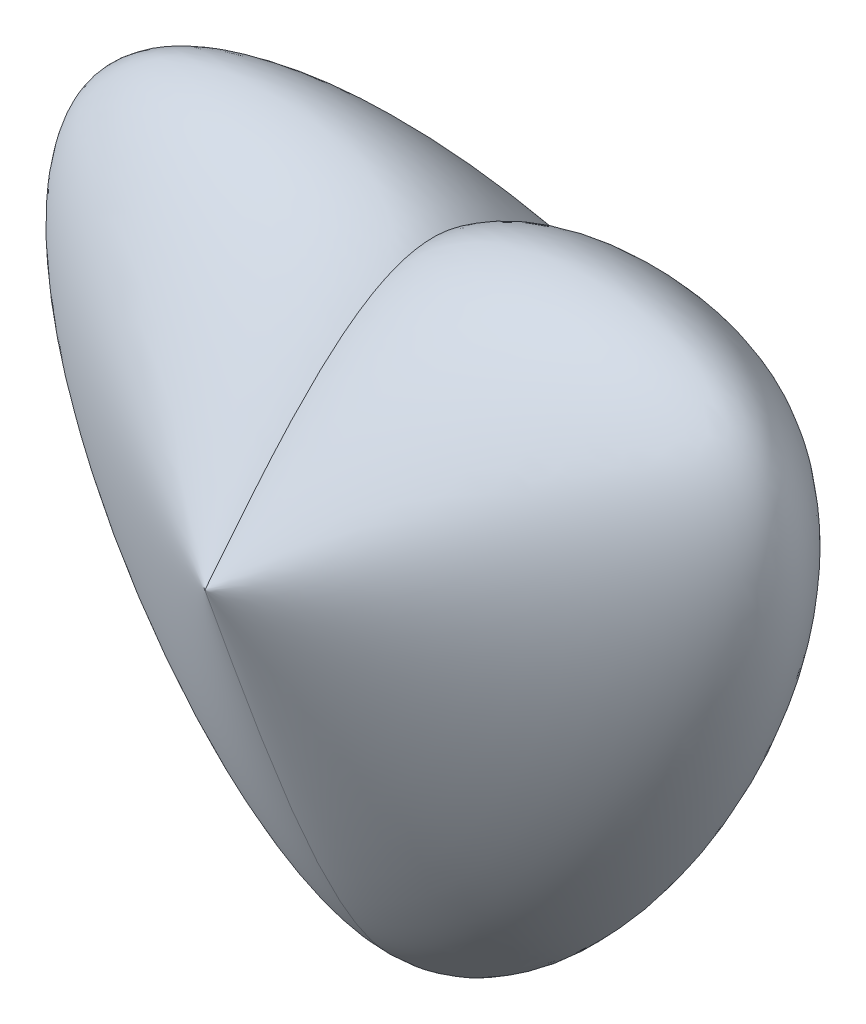
ISO-10303-21;
HEADER;
FILE_DESCRIPTION(('STEP AP214'),'2;1');
FILE_NAME('part.step','',(''),(''),'','','');
FILE_SCHEMA(('AUTOMOTIVE_DESIGN { 1 0 10303 214 1 1 1 1 }'));
ENDSEC;
DATA;
#1=APPLICATION_CONTEXT('core data for automotive mechanical design processes');
#2=APPLICATION_PROTOCOL_DEFINITION('international standard','automotive_design',2000,#1);
#3=PRODUCT_CONTEXT('',#1,'mechanical');
#4=PRODUCT('Part','Part','',(#3));
#5=PRODUCT_RELATED_PRODUCT_CATEGORY('part','',(#4));
#6=PRODUCT_DEFINITION_FORMATION('','',#4);
#7=PRODUCT_DEFINITION_CONTEXT('part definition',#1,'design');
#8=PRODUCT_DEFINITION('design','',#6,#7);
#9=PRODUCT_DEFINITION_SHAPE('','',#8);
#10=(LENGTH_UNIT() NAMED_UNIT(*) SI_UNIT(.MILLI.,.METRE.));
#11=(NAMED_UNIT(*) PLANE_ANGLE_UNIT() SI_UNIT($,.RADIAN.));
#12=(NAMED_UNIT(*) SI_UNIT($,.STERADIAN.) SOLID_ANGLE_UNIT());
#13=UNCERTAINTY_MEASURE_WITH_UNIT(LENGTH_MEASURE(1.E-05),#10,'distance_accuracy_value','');
#14=(GEOMETRIC_REPRESENTATION_CONTEXT(3) GLOBAL_UNCERTAINTY_ASSIGNED_CONTEXT((#13)) GLOBAL_UNIT_ASSIGNED_CONTEXT((#10,
#11,#12)) REPRESENTATION_CONTEXT('',''));
#15=CARTESIAN_POINT('',(0.,0.,0.));
#16=DIRECTION('',(0.,0.,1.));
#17=DIRECTION('',(1.,0.,0.));
#18=AXIS2_PLACEMENT_3D('',#15,#16,#17);
#19=CARTESIAN_POINT('',(0.,21.5085151741974,40.64));
#20=CARTESIAN_POINT('',(0.,-16.7459959470384,54.1866666666667));
#21=CARTESIAN_POINT('',(0.,-93.2550181895098,81.28));
#22=CARTESIAN_POINT('',(0.,-16.7459959470384,108.373333333333));
#23=CARTESIAN_POINT('',(0.,21.5085151741974,121.92));
#24=CARTESIAN_POINT('',(0.,21.5085151741974,40.64));
#25=CARTESIAN_POINT('',(16.0842801103037,-16.9034079224248,54.1866666666667));
#26=CARTESIAN_POINT('',(48.252840330911,-93.727254115669,81.28));
#27=CARTESIAN_POINT('',(16.0842801103037,-16.9034079224248,108.373333333333));
#28=CARTESIAN_POINT('',(0.,21.5085151741974,121.92));
#29=CARTESIAN_POINT('',(0.,21.5085151741974,40.64));
#30=CARTESIAN_POINT('',(54.2980205813406,44.8895777801635,54.1866666666667));
#31=CARTESIAN_POINT('',(162.894061744022,91.6517029920957,81.28));
#32=CARTESIAN_POINT('',(54.2980205813406,44.8895777801635,108.373333333333));
#33=CARTESIAN_POINT('',(0.,21.5085151741974,121.92));
#34=CARTESIAN_POINT('',(0.,21.5085151741974,40.64));
#35=CARTESIAN_POINT('',(6.91953765264594,43.4245517070554,54.1866666666667));
#36=CARTESIAN_POINT('',(20.7586129579378,87.2566247727714,81.28));
#37=CARTESIAN_POINT('',(6.91953765264594,43.4245517070554,108.373333333333));
#38=CARTESIAN_POINT('',(0.,21.5085151741974,121.92));
#39=CARTESIAN_POINT('',(0.,21.5085151741974,40.64));
#40=CARTESIAN_POINT('',(0.,38.5478471589332,54.1866666666667));
#41=CARTESIAN_POINT('',(0.,72.6265111284049,81.28));
#42=CARTESIAN_POINT('',(0.,38.5478471589332,108.373333333333));
#43=CARTESIAN_POINT('',(0.,21.5085151741974,121.92));
#44=B_SPLINE_SURFACE_WITH_KNOTS('',3,3,((#19,#20,#21,#22,#23),(#24,#25,#26,#27,#28),(#29,#30,
#31,#32,#33),(#34,#35,#36,#37,#38),(#39,#40,#41,#42,#43)),.UNSPECIFIED.,.F.,.F.,.F.,(4,1,4),(4,
1,4),(0.,0.698221286763999,1.),(0.,0.5,1.),.UNSPECIFIED.);
#45=CARTESIAN_POINT('',(0.,21.5085151741974,40.64));
#46=CARTESIAN_POINT('',(0.,38.5478471589332,54.1866666666667));
#47=CARTESIAN_POINT('',(0.,72.6265111284049,81.28));
#48=CARTESIAN_POINT('',(0.,38.5478471589332,108.373333333333));
#49=CARTESIAN_POINT('',(0.,21.5085151741974,121.92));
#50=B_SPLINE_CURVE_WITH_KNOTS('',3,(#45,#46,#47,#48,#49),.UNSPECIFIED.,.F.,.F.,(4,1,4),(0.,0.5,
1.),.UNSPECIFIED.);
#51=CARTESIAN_POINT('',(0.,21.5085151741974,40.64));
#52=VERTEX_POINT('',#51);
#53=CARTESIAN_POINT('',(0.,21.5085151741974,121.92));
#54=VERTEX_POINT('',#53);
#55=EDGE_CURVE('E11',#52,#54,#50,.T.);
#56=CARTESIAN_POINT('',(0.,21.5085151741974,40.64));
#57=CARTESIAN_POINT('',(0.,-16.7459959470384,54.1866666666667));
#58=CARTESIAN_POINT('',(0.,-93.2550181895098,81.28));
#59=CARTESIAN_POINT('',(0.,-16.7459959470384,108.373333333333));
#60=CARTESIAN_POINT('',(0.,21.5085151741974,121.92));
#61=B_SPLINE_CURVE_WITH_KNOTS('',3,(#56,#57,#58,#59,#60),.UNSPECIFIED.,.F.,.F.,(4,1,4),(0.,0.5,
1.),.UNSPECIFIED.);
#62=EDGE_CURVE('E40',#54,#52,#61,.F.);
#63=ORIENTED_EDGE('',*,*,#55,.T.);
#64=ORIENTED_EDGE('',*,*,#62,.T.);
#65=EDGE_LOOP('',(#63,#64));
#66=FACE_BOUND('',#65,.T.);
#67=ADVANCED_FACE('F34',(#66),#44,.T.);
#68=CARTESIAN_POINT('',(0.,21.5085151741974,40.64));
#69=CARTESIAN_POINT('',(0.,38.5478471589332,54.1866666666667));
#70=CARTESIAN_POINT('',(0.,72.6265111284049,81.28));
#71=CARTESIAN_POINT('',(0.,38.5478471589332,108.373333333333));
#72=CARTESIAN_POINT('',(0.,21.5085151741974,121.92));
#73=CARTESIAN_POINT('',(0.,21.5085151741974,40.64));
#74=CARTESIAN_POINT('',(-6.91953765264595,43.4245517070554,54.1866666666667));
#75=CARTESIAN_POINT('',(-20.7586129579378,87.2566247727713,81.28));
#76=CARTESIAN_POINT('',(-6.91953765264595,43.4245517070554,108.373333333333));
#77=CARTESIAN_POINT('',(0.,21.5085151741974,121.92));
#78=CARTESIAN_POINT('',(0.,21.5085151741974,40.64));
#79=CARTESIAN_POINT('',(-54.2980205813406,44.8895777801635,54.1866666666667));
#80=CARTESIAN_POINT('',(-162.894061744022,91.6517029920957,81.28));
#81=CARTESIAN_POINT('',(-54.2980205813406,44.8895777801635,108.373333333333));
#82=CARTESIAN_POINT('',(0.,21.5085151741974,121.92));
#83=CARTESIAN_POINT('',(0.,21.5085151741974,40.64));
#84=CARTESIAN_POINT('',(-16.0842801103037,-16.9034079224248,54.1866666666667));
#85=CARTESIAN_POINT('',(-48.252840330911,-93.7272541156691,81.28));
#86=CARTESIAN_POINT('',(-16.0842801103037,-16.9034079224248,108.373333333333));
#87=CARTESIAN_POINT('',(0.,21.5085151741974,121.92));
#88=CARTESIAN_POINT('',(0.,21.5085151741974,40.64));
#89=CARTESIAN_POINT('',(0.,-16.7459959470384,54.1866666666667));
#90=CARTESIAN_POINT('',(0.,-93.2550181895098,81.28));
#91=CARTESIAN_POINT('',(0.,-16.7459959470384,108.373333333333));
#92=CARTESIAN_POINT('',(0.,21.5085151741974,121.92));
#93=B_SPLINE_SURFACE_WITH_KNOTS('',3,3,((#68,#69,#70,#71,#72),(#73,#74,#75,#76,#77),(#78,#79,
#80,#81,#82),(#83,#84,#85,#86,#87),(#88,#89,#90,#91,#92)),.UNSPECIFIED.,.F.,.F.,.F.,(4,1,4),(4,
1,4),(0.,0.301778713236001,1.),(0.,0.5,1.),.UNSPECIFIED.);
#94=ORIENTED_EDGE('',*,*,#62,.F.);
#95=ORIENTED_EDGE('',*,*,#55,.F.);
#96=EDGE_LOOP('',(#94,#95));
#97=FACE_BOUND('',#96,.T.);
#98=ADVANCED_FACE('F36',(#97),#93,.T.);
#99=CLOSED_SHELL('',(#67,#98));
#100=MANIFOLD_SOLID_BREP('B2',#99);
#101=ADVANCED_BREP_SHAPE_REPRESENTATION('',(#18,#100),#14);
#102=SHAPE_DEFINITION_REPRESENTATION(#9,#101);
ENDSEC;
END-ISO-10303-21;
